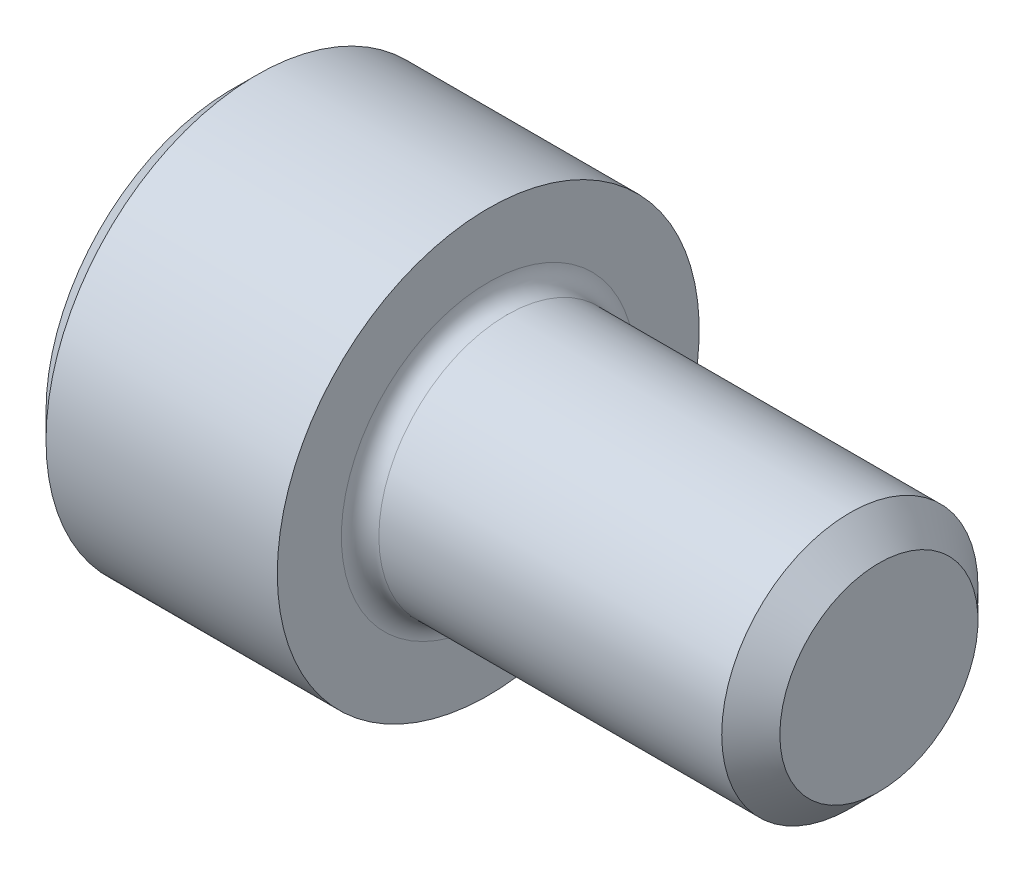
ISO-10303-21;
HEADER;
FILE_DESCRIPTION(('STEP AP214'),'2;1');
FILE_NAME('part.step','',(''),(''),'','','');
FILE_SCHEMA(('AUTOMOTIVE_DESIGN { 1 0 10303 214 1 1 1 1 }'));
ENDSEC;
DATA;
#1=APPLICATION_CONTEXT('core data for automotive mechanical design processes');
#2=APPLICATION_PROTOCOL_DEFINITION('international standard','automotive_design',2000,#1);
#3=PRODUCT_CONTEXT('',#1,'mechanical');
#4=PRODUCT('Part','Part','',(#3));
#5=PRODUCT_RELATED_PRODUCT_CATEGORY('part','',(#4));
#6=PRODUCT_DEFINITION_FORMATION('','',#4);
#7=PRODUCT_DEFINITION_CONTEXT('part definition',#1,'design');
#8=PRODUCT_DEFINITION('design','',#6,#7);
#9=PRODUCT_DEFINITION_SHAPE('','',#8);
#10=(LENGTH_UNIT() NAMED_UNIT(*) SI_UNIT(.MILLI.,.METRE.));
#11=(NAMED_UNIT(*) PLANE_ANGLE_UNIT() SI_UNIT($,.RADIAN.));
#12=(NAMED_UNIT(*) SI_UNIT($,.STERADIAN.) SOLID_ANGLE_UNIT());
#13=UNCERTAINTY_MEASURE_WITH_UNIT(LENGTH_MEASURE(1.E-05),#10,'distance_accuracy_value','');
#14=(GEOMETRIC_REPRESENTATION_CONTEXT(3) GLOBAL_UNCERTAINTY_ASSIGNED_CONTEXT((#13)) GLOBAL_UNIT_ASSIGNED_CONTEXT((#10,
#11,#12)) REPRESENTATION_CONTEXT('',''));
#15=CARTESIAN_POINT('',(0.,0.,0.));
#16=DIRECTION('',(0.,0.,1.));
#17=DIRECTION('',(1.,0.,0.));
#18=AXIS2_PLACEMENT_3D('',#15,#16,#17);
#19=CARTESIAN_POINT('',(0.,0.,0.));
#20=DIRECTION('',(-1.,0.,0.));
#21=DIRECTION('',(0.,0.,1.));
#22=AXIS2_PLACEMENT_3D('',#19,#20,#21);
#23=PLANE('',#22);
#24=DIRECTION('',(0.,-0.499999999999999,0.866025403784439));
#25=VECTOR('',#24,1.);
#26=CARTESIAN_POINT('',(0.,2.05305755723831,0.));
#27=LINE('',#26,#25);
#28=CARTESIAN_POINT('',(0.,2.05305755723831,0.));
#29=VERTEX_POINT('',#28);
#30=CARTESIAN_POINT('',(0.,1.02652877861916,1.778));
#31=VERTEX_POINT('',#30);
#32=EDGE_CURVE('E257',#29,#31,#27,.T.);
#33=ORIENTED_EDGE('',*,*,#32,.T.);
#34=DIRECTION('',(0.,1.,0.));
#35=VECTOR('',#34,1.);
#36=CARTESIAN_POINT('',(0.,-1.02652877861915,1.778));
#37=LINE('',#36,#35);
#38=CARTESIAN_POINT('',(0.,-1.02652877861915,1.778));
#39=VERTEX_POINT('',#38);
#40=EDGE_CURVE('E128',#39,#31,#37,.T.);
#41=ORIENTED_EDGE('',*,*,#40,.F.);
#42=DIRECTION('',(0.,-0.500000000000001,-0.866025403784438));
#43=VECTOR('',#42,1.);
#44=CARTESIAN_POINT('',(0.,-1.02652877861915,1.778));
#45=LINE('',#44,#43);
#46=CARTESIAN_POINT('',(0.,-2.0530575572383,0.));
#47=VERTEX_POINT('',#46);
#48=EDGE_CURVE('E260',#39,#47,#45,.T.);
#49=ORIENTED_EDGE('',*,*,#48,.T.);
#50=DIRECTION('',(0.,0.499999999999999,-0.86602540378444));
#51=VECTOR('',#50,1.);
#52=CARTESIAN_POINT('',(0.,-2.0530575572383,0.));
#53=LINE('',#52,#51);
#54=CARTESIAN_POINT('',(0.,-1.02652877861915,-1.778));
#55=VERTEX_POINT('',#54);
#56=EDGE_CURVE('E263',#47,#55,#53,.T.);
#57=ORIENTED_EDGE('',*,*,#56,.T.);
#58=DIRECTION('',(0.,-1.,0.));
#59=VECTOR('',#58,1.);
#60=CARTESIAN_POINT('',(0.,1.02652877861916,-1.778));
#61=LINE('',#60,#59);
#62=CARTESIAN_POINT('',(0.,1.02652877861916,-1.778));
#63=VERTEX_POINT('',#62);
#64=EDGE_CURVE('E266',#63,#55,#61,.T.);
#65=ORIENTED_EDGE('',*,*,#64,.F.);
#66=DIRECTION('',(0.,-0.500000000000001,-0.866025403784438));
#67=VECTOR('',#66,1.);
#68=CARTESIAN_POINT('',(0.,2.05305755723831,0.));
#69=LINE('',#68,#67);
#70=EDGE_CURVE('E123',#29,#63,#69,.T.);
#71=ORIENTED_EDGE('',*,*,#70,.F.);
#72=EDGE_LOOP('',(#33,#41,#49,#57,#65,#71));
#73=FACE_BOUND('',#72,.T.);
#74=CARTESIAN_POINT('',(0.,0.,0.));
#75=DIRECTION('',(-1.,0.,0.));
#76=DIRECTION('',(0.,0.,1.));
#77=AXIS2_PLACEMENT_3D('',#74,#75,#76);
#78=CIRCLE('',#77,3.0226);
#79=CARTESIAN_POINT('',(0.,0.,3.0226));
#80=VERTEX_POINT('',#79);
#81=EDGE_CURVE('E152',#80,#80,#78,.T.);
#82=ORIENTED_EDGE('',*,*,#81,.T.);
#83=EDGE_LOOP('',(#82));
#84=FACE_BOUND('',#83,.T.);
#85=ADVANCED_FACE('F32',(#73,#84),#23,.T.);
#86=CARTESIAN_POINT('',(0.,0.,0.));
#87=DIRECTION('',(1.,0.,0.));
#88=DIRECTION('',(0.,0.,-1.));
#89=AXIS2_PLACEMENT_3D('',#86,#87,#88);
#90=CONICAL_SURFACE('',#89,3.0226,0.785398163397444);
#91=CARTESIAN_POINT('',(0.406400000000001,0.,0.));
#92=DIRECTION('',(-1.,0.,0.));
#93=DIRECTION('',(0.,0.,1.));
#94=AXIS2_PLACEMENT_3D('',#91,#92,#93);
#95=CIRCLE('',#94,3.429);
#96=CARTESIAN_POINT('',(0.406400000000001,0.,3.429));
#97=VERTEX_POINT('',#96);
#98=EDGE_CURVE('E149',#97,#97,#95,.T.);
#99=ORIENTED_EDGE('',*,*,#98,.T.);
#100=EDGE_LOOP('',(#99));
#101=FACE_BOUND('',#100,.T.);
#102=ORIENTED_EDGE('',*,*,#81,.F.);
#103=EDGE_LOOP('',(#102));
#104=FACE_BOUND('',#103,.T.);
#105=ADVANCED_FACE('F173',(#101,#104),#90,.T.);
#106=CARTESIAN_POINT('',(-31.75,0.,0.));
#107=DIRECTION('',(-1.,0.,0.));
#108=DIRECTION('',(0.,0.,1.));
#109=AXIS2_PLACEMENT_3D('',#106,#107,#108);
#110=CYLINDRICAL_SURFACE('',#109,3.429);
#111=CARTESIAN_POINT('',(4.1656,0.,0.));
#112=DIRECTION('',(-1.,0.,0.));
#113=DIRECTION('',(0.,0.,1.));
#114=AXIS2_PLACEMENT_3D('',#111,#112,#113);
#115=CIRCLE('',#114,3.429);
#116=CARTESIAN_POINT('',(4.1656,0.,3.429));
#117=VERTEX_POINT('',#116);
#118=EDGE_CURVE('E146',#117,#117,#115,.T.);
#119=ORIENTED_EDGE('',*,*,#118,.T.);
#120=EDGE_LOOP('',(#119));
#121=FACE_BOUND('',#120,.T.);
#122=ORIENTED_EDGE('',*,*,#98,.F.);
#123=EDGE_LOOP('',(#122));
#124=FACE_BOUND('',#123,.T.);
#125=ADVANCED_FACE('F178',(#121,#124),#110,.T.);
#126=CARTESIAN_POINT('',(4.1656,3.429,0.));
#127=DIRECTION('',(1.,0.,0.));
#128=DIRECTION('',(0.,0.,-1.));
#129=AXIS2_PLACEMENT_3D('',#126,#127,#128);
#130=PLANE('',#129);
#131=CARTESIAN_POINT('',(4.1656,0.,0.));
#132=DIRECTION('',(1.,0.,0.));
#133=DIRECTION('',(0.,0.,-1.));
#134=AXIS2_PLACEMENT_3D('',#131,#132,#133);
#135=CIRCLE('',#134,2.38759999999997);
#136=CARTESIAN_POINT('',(4.1656,0.,-2.38759999999997));
#137=VERTEX_POINT('',#136);
#138=EDGE_CURVE('E40',#137,#137,#135,.F.);
#139=ORIENTED_EDGE('',*,*,#138,.T.);
#140=EDGE_LOOP('',(#139));
#141=FACE_BOUND('',#140,.T.);
#142=ORIENTED_EDGE('',*,*,#118,.F.);
#143=EDGE_LOOP('',(#142));
#144=FACE_BOUND('',#143,.T.);
#145=ADVANCED_FACE('F157',(#141,#144),#130,.T.);
#146=CARTESIAN_POINT('',(-31.75,0.,0.));
#147=DIRECTION('',(-1.,0.,0.));
#148=DIRECTION('',(0.,0.,1.));
#149=AXIS2_PLACEMENT_3D('',#146,#147,#148);
#150=CYLINDRICAL_SURFACE('',#149,2.08279999999997);
#151=CARTESIAN_POINT('',(4.4704,0.,0.));
#152=DIRECTION('',(1.,0.,0.));
#153=DIRECTION('',(0.,0.,-1.));
#154=AXIS2_PLACEMENT_3D('',#151,#152,#153);
#155=CIRCLE('',#154,2.08279999999997);
#156=CARTESIAN_POINT('',(4.4704,0.,-2.08279999999997));
#157=VERTEX_POINT('',#156);
#158=EDGE_CURVE('E11',#157,#157,#155,.T.);
#159=ORIENTED_EDGE('',*,*,#158,.T.);
#160=EDGE_LOOP('',(#159));
#161=FACE_BOUND('',#160,.T.);
#162=CARTESIAN_POINT('',(10.04316,0.,0.));
#163=DIRECTION('',(-1.,0.,0.));
#164=DIRECTION('',(0.,0.,1.));
#165=AXIS2_PLACEMENT_3D('',#162,#163,#164);
#166=CIRCLE('',#165,2.08279999999994);
#167=CARTESIAN_POINT('',(10.04316,0.,2.08279999999994));
#168=VERTEX_POINT('',#167);
#169=EDGE_CURVE('E143',#168,#168,#166,.T.);
#170=ORIENTED_EDGE('',*,*,#169,.T.);
#171=EDGE_LOOP('',(#170));
#172=FACE_BOUND('',#171,.T.);
#173=ADVANCED_FACE('F188',(#161,#172),#150,.T.);
#174=CARTESIAN_POINT('',(10.5156,0.,0.));
#175=DIRECTION('',(-1.,0.,0.));
#176=DIRECTION('',(0.,0.,1.));
#177=AXIS2_PLACEMENT_3D('',#174,#175,#176);
#178=CONICAL_SURFACE('',#177,1.61036,0.785398163397344);
#179=ORIENTED_EDGE('',*,*,#169,.F.);
#180=EDGE_LOOP('',(#179));
#181=FACE_BOUND('',#180,.T.);
#182=CARTESIAN_POINT('',(10.5156,0.,0.));
#183=DIRECTION('',(-1.,0.,0.));
#184=DIRECTION('',(0.,0.,1.));
#185=AXIS2_PLACEMENT_3D('',#182,#183,#184);
#186=CIRCLE('',#185,1.61036);
#187=CARTESIAN_POINT('',(10.5156,0.,1.61036));
#188=VERTEX_POINT('',#187);
#189=EDGE_CURVE('E139',#188,#188,#186,.T.);
#190=ORIENTED_EDGE('',*,*,#189,.T.);
#191=EDGE_LOOP('',(#190));
#192=FACE_BOUND('',#191,.T.);
#193=ADVANCED_FACE('F168',(#181,#192),#178,.T.);
#194=CARTESIAN_POINT('',(10.5156,1.61036,0.));
#195=DIRECTION('',(1.,0.,0.));
#196=DIRECTION('',(0.,0.,-1.));
#197=AXIS2_PLACEMENT_3D('',#194,#195,#196);
#198=PLANE('',#197);
#199=ORIENTED_EDGE('',*,*,#189,.F.);
#200=EDGE_LOOP('',(#199));
#201=FACE_BOUND('',#200,.T.);
#202=ADVANCED_FACE('F161',(#201),#198,.T.);
#203=CARTESIAN_POINT('',(4.4704,0.,0.));
#204=DIRECTION('',(1.,0.,0.));
#205=DIRECTION('',(0.,0.,-1.));
#206=AXIS2_PLACEMENT_3D('',#203,#204,#205);
#207=TOROIDAL_SURFACE('',#206,2.38759999999997,0.3048);
#208=ORIENTED_EDGE('',*,*,#158,.F.);
#209=EDGE_LOOP('',(#208));
#210=FACE_BOUND('',#209,.T.);
#211=ORIENTED_EDGE('',*,*,#138,.F.);
#212=EDGE_LOOP('',(#211));
#213=FACE_BOUND('',#212,.T.);
#214=ADVANCED_FACE('F34',(#210,#213),#207,.F.);
#215=CARTESIAN_POINT('',(1.9558,2.05305755723831,0.));
#216=DIRECTION('',(0.,-0.866025403784439,-0.499999999999999));
#217=DIRECTION('',(0.,0.499999999999999,-0.86602540378444));
#218=AXIS2_PLACEMENT_3D('',#215,#216,#217);
#219=PLANE('',#218);
#220=ORIENTED_EDGE('',*,*,#32,.F.);
#221=DIRECTION('',(-1.,0.,0.));
#222=VECTOR('',#221,1.);
#223=CARTESIAN_POINT('',(1.9558,2.05305755723831,0.));
#224=LINE('',#223,#222);
#225=CARTESIAN_POINT('',(1.9558,2.05305755723831,0.));
#226=VERTEX_POINT('',#225);
#227=EDGE_CURVE('E247',#226,#29,#224,.T.);
#228=ORIENTED_EDGE('',*,*,#227,.F.);
#229=DIRECTION('',(0.,-0.499999999999999,0.866025403784439));
#230=VECTOR('',#229,1.);
#231=CARTESIAN_POINT('',(1.9558,2.05305755723831,0.));
#232=LINE('',#231,#230);
#233=CARTESIAN_POINT('',(1.9558,1.53979316792874,0.888999999999999));
#234=VERTEX_POINT('',#233);
#235=EDGE_CURVE('E115',#226,#234,#232,.T.);
#236=ORIENTED_EDGE('',*,*,#235,.T.);
#237=CARTESIAN_POINT('',(1.9558,1.02652877861916,1.778));
#238=VERTEX_POINT('',#237);
#239=EDGE_CURVE('E106',#234,#238,#232,.T.);
#240=ORIENTED_EDGE('',*,*,#239,.T.);
#241=DIRECTION('',(-1.,0.,0.));
#242=VECTOR('',#241,1.);
#243=CARTESIAN_POINT('',(1.9558,1.02652877861916,1.778));
#244=LINE('',#243,#242);
#245=EDGE_CURVE('E120',#238,#31,#244,.T.);
#246=ORIENTED_EDGE('',*,*,#245,.T.);
#247=EDGE_LOOP('',(#220,#228,#236,#240,#246));
#248=FACE_BOUND('',#247,.T.);
#249=ADVANCED_FACE('F119',(#248),#219,.T.);
#250=CARTESIAN_POINT('',(1.9558,-1.02652877861915,1.778));
#251=DIRECTION('',(0.,0.,1.));
#252=DIRECTION('',(0.,-1.,0.));
#253=AXIS2_PLACEMENT_3D('',#250,#251,#252);
#254=PLANE('',#253);
#255=ORIENTED_EDGE('',*,*,#40,.T.);
#256=ORIENTED_EDGE('',*,*,#245,.F.);
#257=DIRECTION('',(0.,1.,0.));
#258=VECTOR('',#257,1.);
#259=CARTESIAN_POINT('',(1.9558,-1.02652877861915,1.778));
#260=LINE('',#259,#258);
#261=CARTESIAN_POINT('',(1.9558,0.,1.778));
#262=VERTEX_POINT('',#261);
#263=EDGE_CURVE('E103',#262,#238,#260,.T.);
#264=ORIENTED_EDGE('',*,*,#263,.F.);
#265=CARTESIAN_POINT('',(1.9558,-1.02652877861915,1.778));
#266=VERTEX_POINT('',#265);
#267=EDGE_CURVE('E114',#266,#262,#260,.T.);
#268=ORIENTED_EDGE('',*,*,#267,.F.);
#269=DIRECTION('',(-1.,0.,0.));
#270=VECTOR('',#269,1.);
#271=CARTESIAN_POINT('',(1.9558,-1.02652877861915,1.778));
#272=LINE('',#271,#270);
#273=EDGE_CURVE('E130',#266,#39,#272,.T.);
#274=ORIENTED_EDGE('',*,*,#273,.T.);
#275=EDGE_LOOP('',(#255,#256,#264,#268,#274));
#276=FACE_BOUND('',#275,.T.);
#277=ADVANCED_FACE('F125',(#276),#254,.F.);
#278=CARTESIAN_POINT('',(1.9558,-1.02652877861915,1.778));
#279=DIRECTION('',(0.,0.866025403784438,-0.500000000000001));
#280=DIRECTION('',(0.,0.500000000000001,0.866025403784438));
#281=AXIS2_PLACEMENT_3D('',#278,#279,#280);
#282=PLANE('',#281);
#283=ORIENTED_EDGE('',*,*,#48,.F.);
#284=ORIENTED_EDGE('',*,*,#273,.F.);
#285=DIRECTION('',(0.,-0.500000000000001,-0.866025403784438));
#286=VECTOR('',#285,1.);
#287=CARTESIAN_POINT('',(1.9558,-1.02652877861915,1.778));
#288=LINE('',#287,#286);
#289=CARTESIAN_POINT('',(1.9558,-1.53979316792873,0.888999999999999));
#290=VERTEX_POINT('',#289);
#291=EDGE_CURVE('E286',#266,#290,#288,.T.);
#292=ORIENTED_EDGE('',*,*,#291,.T.);
#293=CARTESIAN_POINT('',(1.9558,-2.0530575572383,0.));
#294=VERTEX_POINT('',#293);
#295=EDGE_CURVE('E275',#290,#294,#288,.T.);
#296=ORIENTED_EDGE('',*,*,#295,.T.);
#297=DIRECTION('',(-1.,0.,0.));
#298=VECTOR('',#297,1.);
#299=CARTESIAN_POINT('',(1.9558,-2.0530575572383,0.));
#300=LINE('',#299,#298);
#301=EDGE_CURVE('E135',#294,#47,#300,.T.);
#302=ORIENTED_EDGE('',*,*,#301,.T.);
#303=EDGE_LOOP('',(#283,#284,#292,#296,#302));
#304=FACE_BOUND('',#303,.T.);
#305=ADVANCED_FACE('F201',(#304),#282,.T.);
#306=CARTESIAN_POINT('',(1.9558,-2.0530575572383,0.));
#307=DIRECTION('',(0.,0.86602540378444,0.499999999999999));
#308=DIRECTION('',(0.,-0.499999999999999,0.86602540378444));
#309=AXIS2_PLACEMENT_3D('',#306,#307,#308);
#310=PLANE('',#309);
#311=ORIENTED_EDGE('',*,*,#56,.F.);
#312=ORIENTED_EDGE('',*,*,#301,.F.);
#313=DIRECTION('',(0.,0.499999999999999,-0.86602540378444));
#314=VECTOR('',#313,1.);
#315=CARTESIAN_POINT('',(1.9558,-2.0530575572383,0.));
#316=LINE('',#315,#314);
#317=CARTESIAN_POINT('',(1.9558,-1.53979316792873,-0.888999999999995));
#318=VERTEX_POINT('',#317);
#319=EDGE_CURVE('E253',#294,#318,#316,.T.);
#320=ORIENTED_EDGE('',*,*,#319,.T.);
#321=CARTESIAN_POINT('',(1.9558,-1.02652877861915,-1.778));
#322=VERTEX_POINT('',#321);
#323=EDGE_CURVE('E285',#318,#322,#316,.T.);
#324=ORIENTED_EDGE('',*,*,#323,.T.);
#325=DIRECTION('',(-1.,0.,0.));
#326=VECTOR('',#325,1.);
#327=CARTESIAN_POINT('',(1.9558,-1.02652877861915,-1.778));
#328=LINE('',#327,#326);
#329=EDGE_CURVE('E246',#322,#55,#328,.T.);
#330=ORIENTED_EDGE('',*,*,#329,.T.);
#331=EDGE_LOOP('',(#311,#312,#320,#324,#330));
#332=FACE_BOUND('',#331,.T.);
#333=ADVANCED_FACE('F204',(#332),#310,.T.);
#334=CARTESIAN_POINT('',(1.9558,1.02652877861916,-1.778));
#335=DIRECTION('',(0.,0.,-1.));
#336=DIRECTION('',(0.,1.,0.));
#337=AXIS2_PLACEMENT_3D('',#334,#335,#336);
#338=PLANE('',#337);
#339=ORIENTED_EDGE('',*,*,#64,.T.);
#340=ORIENTED_EDGE('',*,*,#329,.F.);
#341=DIRECTION('',(0.,-1.,0.));
#342=VECTOR('',#341,1.);
#343=CARTESIAN_POINT('',(1.9558,1.02652877861916,-1.778));
#344=LINE('',#343,#342);
#345=CARTESIAN_POINT('',(1.9558,0.,-1.778));
#346=VERTEX_POINT('',#345);
#347=EDGE_CURVE('E250',#346,#322,#344,.T.);
#348=ORIENTED_EDGE('',*,*,#347,.F.);
#349=CARTESIAN_POINT('',(1.9558,1.02652877861916,-1.778));
#350=VERTEX_POINT('',#349);
#351=EDGE_CURVE('E47',#350,#346,#344,.T.);
#352=ORIENTED_EDGE('',*,*,#351,.F.);
#353=DIRECTION('',(-1.,0.,0.));
#354=VECTOR('',#353,1.);
#355=CARTESIAN_POINT('',(1.9558,1.02652877861916,-1.778));
#356=LINE('',#355,#354);
#357=EDGE_CURVE('E243',#350,#63,#356,.T.);
#358=ORIENTED_EDGE('',*,*,#357,.T.);
#359=EDGE_LOOP('',(#339,#340,#348,#352,#358));
#360=FACE_BOUND('',#359,.T.);
#361=ADVANCED_FACE('F208',(#360),#338,.F.);
#362=CARTESIAN_POINT('',(1.9558,2.05305755723831,0.));
#363=DIRECTION('',(0.,0.866025403784438,-0.500000000000001));
#364=DIRECTION('',(0.,0.500000000000001,0.866025403784438));
#365=AXIS2_PLACEMENT_3D('',#362,#363,#364);
#366=PLANE('',#365);
#367=ORIENTED_EDGE('',*,*,#70,.T.);
#368=ORIENTED_EDGE('',*,*,#357,.F.);
#369=DIRECTION('',(0.,-0.500000000000001,-0.866025403784438));
#370=VECTOR('',#369,1.);
#371=CARTESIAN_POINT('',(1.9558,2.05305755723831,0.));
#372=LINE('',#371,#370);
#373=CARTESIAN_POINT('',(1.9558,1.53979316792873,-0.889000000000004));
#374=VERTEX_POINT('',#373);
#375=EDGE_CURVE('E233',#374,#350,#372,.T.);
#376=ORIENTED_EDGE('',*,*,#375,.F.);
#377=EDGE_CURVE('E239',#226,#374,#372,.T.);
#378=ORIENTED_EDGE('',*,*,#377,.F.);
#379=ORIENTED_EDGE('',*,*,#227,.T.);
#380=EDGE_LOOP('',(#367,#368,#376,#378,#379));
#381=FACE_BOUND('',#380,.T.);
#382=ADVANCED_FACE('F212',(#381),#366,.F.);
#383=CARTESIAN_POINT('',(1.9558,3.07958633585746,-1.778));
#384=DIRECTION('',(1.,0.,0.));
#385=DIRECTION('',(0.,0.,-1.));
#386=AXIS2_PLACEMENT_3D('',#383,#384,#385);
#387=PLANE('',#386);
#388=ORIENTED_EDGE('',*,*,#347,.T.);
#389=ORIENTED_EDGE('',*,*,#323,.F.);
#390=CARTESIAN_POINT('',(1.9558,0.,0.));
#391=DIRECTION('',(-1.,0.,0.));
#392=DIRECTION('',(0.,0.,1.));
#393=AXIS2_PLACEMENT_3D('',#390,#391,#392);
#394=CIRCLE('',#393,1.778);
#395=EDGE_CURVE('E281',#346,#318,#394,.T.);
#396=ORIENTED_EDGE('',*,*,#395,.F.);
#397=EDGE_LOOP('',(#388,#389,#396));
#398=FACE_BOUND('',#397,.T.);
#399=ADVANCED_FACE('F216',(#398),#387,.F.);
#400=ORIENTED_EDGE('',*,*,#319,.F.);
#401=ORIENTED_EDGE('',*,*,#295,.F.);
#402=EDGE_CURVE('E133',#318,#290,#394,.T.);
#403=ORIENTED_EDGE('',*,*,#402,.F.);
#404=EDGE_LOOP('',(#400,#401,#403));
#405=FACE_BOUND('',#404,.T.);
#406=ADVANCED_FACE('F219',(#405),#387,.F.);
#407=ORIENTED_EDGE('',*,*,#291,.F.);
#408=ORIENTED_EDGE('',*,*,#267,.T.);
#409=EDGE_CURVE('E129',#290,#262,#394,.T.);
#410=ORIENTED_EDGE('',*,*,#409,.F.);
#411=EDGE_LOOP('',(#407,#408,#410));
#412=FACE_BOUND('',#411,.T.);
#413=ADVANCED_FACE('F224',(#412),#387,.F.);
#414=ORIENTED_EDGE('',*,*,#263,.T.);
#415=ORIENTED_EDGE('',*,*,#239,.F.);
#416=EDGE_CURVE('E109',#262,#234,#394,.T.);
#417=ORIENTED_EDGE('',*,*,#416,.F.);
#418=EDGE_LOOP('',(#414,#415,#417));
#419=FACE_BOUND('',#418,.T.);
#420=ADVANCED_FACE('F105',(#419),#387,.F.);
#421=ORIENTED_EDGE('',*,*,#235,.F.);
#422=ORIENTED_EDGE('',*,*,#377,.T.);
#423=EDGE_CURVE('E140',#234,#374,#394,.T.);
#424=ORIENTED_EDGE('',*,*,#423,.F.);
#425=EDGE_LOOP('',(#421,#422,#424));
#426=FACE_BOUND('',#425,.T.);
#427=ADVANCED_FACE('F227',(#426),#387,.F.);
#428=ORIENTED_EDGE('',*,*,#375,.T.);
#429=ORIENTED_EDGE('',*,*,#351,.T.);
#430=EDGE_CURVE('E236',#374,#346,#394,.T.);
#431=ORIENTED_EDGE('',*,*,#430,.F.);
#432=EDGE_LOOP('',(#428,#429,#431));
#433=FACE_BOUND('',#432,.T.);
#434=ADVANCED_FACE('F197',(#433),#387,.F.);
#435=CARTESIAN_POINT('',(1.9558,0.,0.));
#436=DIRECTION('',(-1.,0.,0.));
#437=DIRECTION('',(0.,0.,1.));
#438=AXIS2_PLACEMENT_3D('',#435,#436,#437);
#439=CONICAL_SURFACE('',#438,1.778,1.04719755119659);
#440=CARTESIAN_POINT('',(2.98232877861917,0.,0.));
#441=VERTEX_POINT('',#440);
#442=VERTEX_LOOP('',#441);
#443=FACE_BOUND('',#442,.T.);
#444=ORIENTED_EDGE('',*,*,#416,.T.);
#445=ORIENTED_EDGE('',*,*,#423,.T.);
#446=ORIENTED_EDGE('',*,*,#430,.T.);
#447=ORIENTED_EDGE('',*,*,#395,.T.);
#448=ORIENTED_EDGE('',*,*,#402,.T.);
#449=ORIENTED_EDGE('',*,*,#409,.T.);
#450=EDGE_LOOP('',(#444,#445,#446,#447,#448,#449));
#451=FACE_BOUND('',#450,.T.);
#452=ADVANCED_FACE('F195',(#443,#451),#439,.F.);
#453=CLOSED_SHELL('',(#85,#105,#125,#145,#173,#193,#202,#214,#249,#277,#305,#333,#361,#382,#399,
#406,#413,#420,#427,#434,#452));
#454=MANIFOLD_SOLID_BREP('B2',#453);
#455=ADVANCED_BREP_SHAPE_REPRESENTATION('',(#18,#454),#14);
#456=SHAPE_DEFINITION_REPRESENTATION(#9,#455);
ENDSEC;
END-ISO-10303-21;
